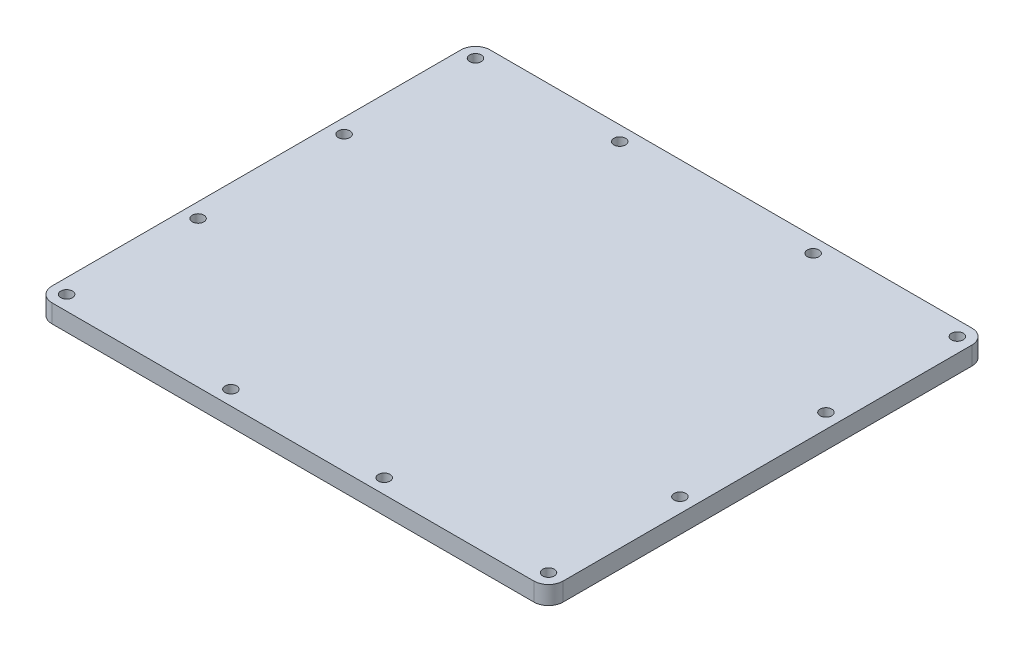
ISO-10303-21;
HEADER;
FILE_DESCRIPTION(('STEP AP214'),'2;1');
FILE_NAME('part.step','',(''),(''),'','','');
FILE_SCHEMA(('AUTOMOTIVE_DESIGN { 1 0 10303 214 1 1 1 1 }'));
ENDSEC;
DATA;
#1=APPLICATION_CONTEXT('core data for automotive mechanical design processes');
#2=APPLICATION_PROTOCOL_DEFINITION('international standard','automotive_design',2000,#1);
#3=PRODUCT_CONTEXT('',#1,'mechanical');
#4=PRODUCT('Part','Part','',(#3));
#5=PRODUCT_RELATED_PRODUCT_CATEGORY('part','',(#4));
#6=PRODUCT_DEFINITION_FORMATION('','',#4);
#7=PRODUCT_DEFINITION_CONTEXT('part definition',#1,'design');
#8=PRODUCT_DEFINITION('design','',#6,#7);
#9=PRODUCT_DEFINITION_SHAPE('','',#8);
#10=(LENGTH_UNIT() NAMED_UNIT(*) SI_UNIT(.MILLI.,.METRE.));
#11=(NAMED_UNIT(*) PLANE_ANGLE_UNIT() SI_UNIT($,.RADIAN.));
#12=(NAMED_UNIT(*) SI_UNIT($,.STERADIAN.) SOLID_ANGLE_UNIT());
#13=UNCERTAINTY_MEASURE_WITH_UNIT(LENGTH_MEASURE(1.E-05),#10,'distance_accuracy_value','');
#14=(GEOMETRIC_REPRESENTATION_CONTEXT(3) GLOBAL_UNCERTAINTY_ASSIGNED_CONTEXT((#13)) GLOBAL_UNIT_ASSIGNED_CONTEXT((#10,
#11,#12)) REPRESENTATION_CONTEXT('',''));
#15=CARTESIAN_POINT('',(0.,0.,0.));
#16=DIRECTION('',(0.,0.,1.));
#17=DIRECTION('',(1.,0.,0.));
#18=AXIS2_PLACEMENT_3D('',#15,#16,#17);
#19=CARTESIAN_POINT('',(66.,5.,56.));
#20=DIRECTION('',(0.,-1.,0.));
#21=DIRECTION('',(0.,0.,-1.));
#22=AXIS2_PLACEMENT_3D('',#19,#20,#21);
#23=PLANE('',#22);
#24=CARTESIAN_POINT('',(66.,5.,56.));
#25=DIRECTION('',(0.,1.,0.));
#26=DIRECTION('',(0.,0.,-1.));
#27=AXIS2_PLACEMENT_3D('',#24,#25,#26);
#28=CIRCLE('',#27,4.);
#29=CARTESIAN_POINT('',(66.,5.,60.));
#30=VERTEX_POINT('',#29);
#31=CARTESIAN_POINT('',(70.,5.,56.));
#32=VERTEX_POINT('',#31);
#33=EDGE_CURVE('E145',#30,#32,#28,.T.);
#34=ORIENTED_EDGE('',*,*,#33,.T.);
#35=DIRECTION('',(0.,0.,-1.));
#36=VECTOR('',#35,1.);
#37=CARTESIAN_POINT('',(70.,5.,56.));
#38=LINE('',#37,#36);
#39=CARTESIAN_POINT('',(70.,5.,-56.));
#40=VERTEX_POINT('',#39);
#41=EDGE_CURVE('E93',#32,#40,#38,.T.);
#42=ORIENTED_EDGE('',*,*,#41,.T.);
#43=CARTESIAN_POINT('',(66.,5.,-56.));
#44=DIRECTION('',(0.,1.,0.));
#45=DIRECTION('',(0.,0.,-1.));
#46=AXIS2_PLACEMENT_3D('',#43,#44,#45);
#47=CIRCLE('',#46,4.);
#48=CARTESIAN_POINT('',(66.,5.,-60.));
#49=VERTEX_POINT('',#48);
#50=EDGE_CURVE('E160',#40,#49,#47,.T.);
#51=ORIENTED_EDGE('',*,*,#50,.T.);
#52=DIRECTION('',(-1.,0.,0.));
#53=VECTOR('',#52,1.);
#54=CARTESIAN_POINT('',(-66.,5.,-60.));
#55=LINE('',#54,#53);
#56=CARTESIAN_POINT('',(-66.,5.,-60.));
#57=VERTEX_POINT('',#56);
#58=EDGE_CURVE('E173',#49,#57,#55,.T.);
#59=ORIENTED_EDGE('',*,*,#58,.T.);
#60=CARTESIAN_POINT('',(-66.,5.,-56.));
#61=DIRECTION('',(0.,1.,0.));
#62=DIRECTION('',(0.,0.,1.));
#63=AXIS2_PLACEMENT_3D('',#60,#61,#62);
#64=CIRCLE('',#63,4.);
#65=CARTESIAN_POINT('',(-70.,5.,-56.));
#66=VERTEX_POINT('',#65);
#67=EDGE_CURVE('E112',#57,#66,#64,.T.);
#68=ORIENTED_EDGE('',*,*,#67,.T.);
#69=DIRECTION('',(0.,0.,1.));
#70=VECTOR('',#69,1.);
#71=CARTESIAN_POINT('',(-70.,5.,56.));
#72=LINE('',#71,#70);
#73=CARTESIAN_POINT('',(-70.,5.,56.));
#74=VERTEX_POINT('',#73);
#75=EDGE_CURVE('E106',#66,#74,#72,.T.);
#76=ORIENTED_EDGE('',*,*,#75,.T.);
#77=CARTESIAN_POINT('',(-66.,5.,56.));
#78=DIRECTION('',(0.,1.,0.));
#79=DIRECTION('',(0.,0.,1.));
#80=AXIS2_PLACEMENT_3D('',#77,#78,#79);
#81=CIRCLE('',#80,4.);
#82=CARTESIAN_POINT('',(-66.,5.,60.));
#83=VERTEX_POINT('',#82);
#84=EDGE_CURVE('E110',#74,#83,#81,.T.);
#85=ORIENTED_EDGE('',*,*,#84,.T.);
#86=DIRECTION('',(1.,0.,0.));
#87=VECTOR('',#86,1.);
#88=CARTESIAN_POINT('',(-66.,5.,60.));
#89=LINE('',#88,#87);
#90=EDGE_CURVE('E50',#83,#30,#89,.T.);
#91=ORIENTED_EDGE('',*,*,#90,.T.);
#92=EDGE_LOOP('',(#34,#42,#51,#59,#68,#76,#85,#91));
#93=FACE_BOUND('',#92,.T.);
#94=CARTESIAN_POINT('',(-66.,5.,-56.));
#95=DIRECTION('',(0.,1.,0.));
#96=DIRECTION('',(0.,0.,1.));
#97=AXIS2_PLACEMENT_3D('',#94,#95,#96);
#98=CIRCLE('',#97,1.60000000000001);
#99=CARTESIAN_POINT('',(-66.,5.,-54.4));
#100=VERTEX_POINT('',#99);
#101=EDGE_CURVE('E134',#100,#100,#98,.T.);
#102=ORIENTED_EDGE('',*,*,#101,.F.);
#103=EDGE_LOOP('',(#102));
#104=FACE_BOUND('',#103,.T.);
#105=CARTESIAN_POINT('',(-66.,5.,56.));
#106=DIRECTION('',(0.,1.,0.));
#107=DIRECTION('',(0.,0.,1.));
#108=AXIS2_PLACEMENT_3D('',#105,#106,#107);
#109=CIRCLE('',#108,1.60000000000001);
#110=CARTESIAN_POINT('',(-66.,5.,57.6));
#111=VERTEX_POINT('',#110);
#112=EDGE_CURVE('E182',#111,#111,#109,.T.);
#113=ORIENTED_EDGE('',*,*,#112,.F.);
#114=EDGE_LOOP('',(#113));
#115=FACE_BOUND('',#114,.T.);
#116=CARTESIAN_POINT('',(66.,5.,56.));
#117=DIRECTION('',(0.,1.,0.));
#118=DIRECTION('',(0.,0.,1.));
#119=AXIS2_PLACEMENT_3D('',#116,#117,#118);
#120=CIRCLE('',#119,1.60000000000001);
#121=CARTESIAN_POINT('',(66.,5.,57.6));
#122=VERTEX_POINT('',#121);
#123=EDGE_CURVE('E188',#122,#122,#120,.T.);
#124=ORIENTED_EDGE('',*,*,#123,.F.);
#125=EDGE_LOOP('',(#124));
#126=FACE_BOUND('',#125,.T.);
#127=CARTESIAN_POINT('',(66.,5.,-56.));
#128=DIRECTION('',(0.,1.,0.));
#129=DIRECTION('',(0.,0.,1.));
#130=AXIS2_PLACEMENT_3D('',#127,#128,#129);
#131=CIRCLE('',#130,1.60000000000001);
#132=CARTESIAN_POINT('',(66.,5.,-54.4));
#133=VERTEX_POINT('',#132);
#134=EDGE_CURVE('E194',#133,#133,#131,.T.);
#135=ORIENTED_EDGE('',*,*,#134,.F.);
#136=EDGE_LOOP('',(#135));
#137=FACE_BOUND('',#136,.T.);
#138=CARTESIAN_POINT('',(-66.,5.,20.));
#139=DIRECTION('',(0.,1.,0.));
#140=DIRECTION('',(0.,0.,1.));
#141=AXIS2_PLACEMENT_3D('',#138,#139,#140);
#142=CIRCLE('',#141,1.6);
#143=CARTESIAN_POINT('',(-66.,5.,21.6));
#144=VERTEX_POINT('',#143);
#145=EDGE_CURVE('E200',#144,#144,#142,.T.);
#146=ORIENTED_EDGE('',*,*,#145,.F.);
#147=EDGE_LOOP('',(#146));
#148=FACE_BOUND('',#147,.T.);
#149=CARTESIAN_POINT('',(66.,5.,20.));
#150=DIRECTION('',(0.,1.,0.));
#151=DIRECTION('',(0.,0.,1.));
#152=AXIS2_PLACEMENT_3D('',#149,#150,#151);
#153=CIRCLE('',#152,1.6);
#154=CARTESIAN_POINT('',(66.,5.,21.6));
#155=VERTEX_POINT('',#154);
#156=EDGE_CURVE('E206',#155,#155,#153,.T.);
#157=ORIENTED_EDGE('',*,*,#156,.F.);
#158=EDGE_LOOP('',(#157));
#159=FACE_BOUND('',#158,.T.);
#160=CARTESIAN_POINT('',(-66.,5.,-20.));
#161=DIRECTION('',(0.,1.,0.));
#162=DIRECTION('',(0.,0.,1.));
#163=AXIS2_PLACEMENT_3D('',#160,#161,#162);
#164=CIRCLE('',#163,1.6);
#165=CARTESIAN_POINT('',(-66.,5.,-18.4));
#166=VERTEX_POINT('',#165);
#167=EDGE_CURVE('E212',#166,#166,#164,.T.);
#168=ORIENTED_EDGE('',*,*,#167,.F.);
#169=EDGE_LOOP('',(#168));
#170=FACE_BOUND('',#169,.T.);
#171=CARTESIAN_POINT('',(66.,5.,-20.));
#172=DIRECTION('',(0.,1.,0.));
#173=DIRECTION('',(0.,0.,1.));
#174=AXIS2_PLACEMENT_3D('',#171,#172,#173);
#175=CIRCLE('',#174,1.6);
#176=CARTESIAN_POINT('',(66.,5.,-18.4));
#177=VERTEX_POINT('',#176);
#178=EDGE_CURVE('E218',#177,#177,#175,.T.);
#179=ORIENTED_EDGE('',*,*,#178,.F.);
#180=EDGE_LOOP('',(#179));
#181=FACE_BOUND('',#180,.T.);
#182=CARTESIAN_POINT('',(-21.,5.,56.));
#183=DIRECTION('',(0.,1.,0.));
#184=DIRECTION('',(0.,0.,1.));
#185=AXIS2_PLACEMENT_3D('',#182,#183,#184);
#186=CIRCLE('',#185,1.6);
#187=CARTESIAN_POINT('',(-21.,5.,57.6));
#188=VERTEX_POINT('',#187);
#189=EDGE_CURVE('E224',#188,#188,#186,.T.);
#190=ORIENTED_EDGE('',*,*,#189,.F.);
#191=EDGE_LOOP('',(#190));
#192=FACE_BOUND('',#191,.T.);
#193=CARTESIAN_POINT('',(21.,5.,56.));
#194=DIRECTION('',(0.,1.,0.));
#195=DIRECTION('',(0.,0.,1.));
#196=AXIS2_PLACEMENT_3D('',#193,#194,#195);
#197=CIRCLE('',#196,1.6);
#198=CARTESIAN_POINT('',(21.,5.,57.6));
#199=VERTEX_POINT('',#198);
#200=EDGE_CURVE('E230',#199,#199,#197,.T.);
#201=ORIENTED_EDGE('',*,*,#200,.F.);
#202=EDGE_LOOP('',(#201));
#203=FACE_BOUND('',#202,.T.);
#204=CARTESIAN_POINT('',(-26.5,5.,-56.));
#205=DIRECTION('',(0.,1.,0.));
#206=DIRECTION('',(0.,0.,1.));
#207=AXIS2_PLACEMENT_3D('',#204,#205,#206);
#208=CIRCLE('',#207,1.6);
#209=CARTESIAN_POINT('',(-26.5,5.,-54.4));
#210=VERTEX_POINT('',#209);
#211=EDGE_CURVE('E236',#210,#210,#208,.T.);
#212=ORIENTED_EDGE('',*,*,#211,.F.);
#213=EDGE_LOOP('',(#212));
#214=FACE_BOUND('',#213,.T.);
#215=CARTESIAN_POINT('',(26.5,5.,-56.));
#216=DIRECTION('',(0.,1.,0.));
#217=DIRECTION('',(0.,0.,1.));
#218=AXIS2_PLACEMENT_3D('',#215,#216,#217);
#219=CIRCLE('',#218,1.6);
#220=CARTESIAN_POINT('',(26.5,5.,-54.4));
#221=VERTEX_POINT('',#220);
#222=EDGE_CURVE('E242',#221,#221,#219,.T.);
#223=ORIENTED_EDGE('',*,*,#222,.F.);
#224=EDGE_LOOP('',(#223));
#225=FACE_BOUND('',#224,.T.);
#226=ADVANCED_FACE('F33',(#93,#104,#115,#126,#137,#148,#159,#170,#181,#192,#203,#214,#225),#23,.F.);
#227=CARTESIAN_POINT('',(66.,0.,56.));
#228=DIRECTION('',(0.,-1.,0.));
#229=DIRECTION('',(0.,0.,-1.));
#230=AXIS2_PLACEMENT_3D('',#227,#228,#229);
#231=PLANE('',#230);
#232=CARTESIAN_POINT('',(-26.5,0.,-56.));
#233=DIRECTION('',(0.,1.,0.));
#234=DIRECTION('',(0.,0.,1.));
#235=AXIS2_PLACEMENT_3D('',#232,#233,#234);
#236=CIRCLE('',#235,1.6);
#237=CARTESIAN_POINT('',(-26.5,0.,-54.4));
#238=VERTEX_POINT('',#237);
#239=EDGE_CURVE('E239',#238,#238,#236,.T.);
#240=ORIENTED_EDGE('',*,*,#239,.T.);
#241=EDGE_LOOP('',(#240));
#242=FACE_BOUND('',#241,.T.);
#243=CARTESIAN_POINT('',(-21.,0.,56.));
#244=DIRECTION('',(0.,1.,0.));
#245=DIRECTION('',(0.,0.,1.));
#246=AXIS2_PLACEMENT_3D('',#243,#244,#245);
#247=CIRCLE('',#246,1.6);
#248=CARTESIAN_POINT('',(-21.,0.,57.6));
#249=VERTEX_POINT('',#248);
#250=EDGE_CURVE('E227',#249,#249,#247,.T.);
#251=ORIENTED_EDGE('',*,*,#250,.T.);
#252=EDGE_LOOP('',(#251));
#253=FACE_BOUND('',#252,.T.);
#254=CARTESIAN_POINT('',(-66.,0.,-20.));
#255=DIRECTION('',(0.,1.,0.));
#256=DIRECTION('',(0.,0.,1.));
#257=AXIS2_PLACEMENT_3D('',#254,#255,#256);
#258=CIRCLE('',#257,1.6);
#259=CARTESIAN_POINT('',(-66.,0.,-18.4));
#260=VERTEX_POINT('',#259);
#261=EDGE_CURVE('E215',#260,#260,#258,.T.);
#262=ORIENTED_EDGE('',*,*,#261,.T.);
#263=EDGE_LOOP('',(#262));
#264=FACE_BOUND('',#263,.T.);
#265=CARTESIAN_POINT('',(-66.,0.,20.));
#266=DIRECTION('',(0.,1.,0.));
#267=DIRECTION('',(0.,0.,1.));
#268=AXIS2_PLACEMENT_3D('',#265,#266,#267);
#269=CIRCLE('',#268,1.6);
#270=CARTESIAN_POINT('',(-66.,0.,21.6));
#271=VERTEX_POINT('',#270);
#272=EDGE_CURVE('E203',#271,#271,#269,.T.);
#273=ORIENTED_EDGE('',*,*,#272,.T.);
#274=EDGE_LOOP('',(#273));
#275=FACE_BOUND('',#274,.T.);
#276=CARTESIAN_POINT('',(66.,0.,56.));
#277=DIRECTION('',(0.,1.,0.));
#278=DIRECTION('',(0.,0.,1.));
#279=AXIS2_PLACEMENT_3D('',#276,#277,#278);
#280=CIRCLE('',#279,1.60000000000001);
#281=CARTESIAN_POINT('',(66.,0.,57.6));
#282=VERTEX_POINT('',#281);
#283=EDGE_CURVE('E191',#282,#282,#280,.T.);
#284=ORIENTED_EDGE('',*,*,#283,.T.);
#285=EDGE_LOOP('',(#284));
#286=FACE_BOUND('',#285,.T.);
#287=CARTESIAN_POINT('',(-66.,0.,-56.));
#288=DIRECTION('',(0.,1.,0.));
#289=DIRECTION('',(0.,0.,1.));
#290=AXIS2_PLACEMENT_3D('',#287,#288,#289);
#291=CIRCLE('',#290,1.60000000000001);
#292=CARTESIAN_POINT('',(-66.,0.,-54.4));
#293=VERTEX_POINT('',#292);
#294=EDGE_CURVE('E179',#293,#293,#291,.T.);
#295=ORIENTED_EDGE('',*,*,#294,.T.);
#296=EDGE_LOOP('',(#295));
#297=FACE_BOUND('',#296,.T.);
#298=CARTESIAN_POINT('',(66.,0.,56.));
#299=DIRECTION('',(0.,1.,0.));
#300=DIRECTION('',(0.,0.,-1.));
#301=AXIS2_PLACEMENT_3D('',#298,#299,#300);
#302=CIRCLE('',#301,4.);
#303=CARTESIAN_POINT('',(66.,0.,60.));
#304=VERTEX_POINT('',#303);
#305=CARTESIAN_POINT('',(70.,0.,56.));
#306=VERTEX_POINT('',#305);
#307=EDGE_CURVE('E130',#304,#306,#302,.T.);
#308=ORIENTED_EDGE('',*,*,#307,.F.);
#309=DIRECTION('',(1.,0.,0.));
#310=VECTOR('',#309,1.);
#311=CARTESIAN_POINT('',(-66.,0.,60.));
#312=LINE('',#311,#310);
#313=CARTESIAN_POINT('',(-66.,0.,60.));
#314=VERTEX_POINT('',#313);
#315=EDGE_CURVE('E85',#314,#304,#312,.T.);
#316=ORIENTED_EDGE('',*,*,#315,.F.);
#317=CARTESIAN_POINT('',(-66.,0.,56.));
#318=DIRECTION('',(0.,1.,0.));
#319=DIRECTION('',(0.,0.,1.));
#320=AXIS2_PLACEMENT_3D('',#317,#318,#319);
#321=CIRCLE('',#320,4.);
#322=CARTESIAN_POINT('',(-70.,0.,56.));
#323=VERTEX_POINT('',#322);
#324=EDGE_CURVE('E79',#323,#314,#321,.T.);
#325=ORIENTED_EDGE('',*,*,#324,.F.);
#326=DIRECTION('',(0.,0.,1.));
#327=VECTOR('',#326,1.);
#328=CARTESIAN_POINT('',(-70.,0.,56.));
#329=LINE('',#328,#327);
#330=CARTESIAN_POINT('',(-70.,0.,-56.));
#331=VERTEX_POINT('',#330);
#332=EDGE_CURVE('E120',#331,#323,#329,.T.);
#333=ORIENTED_EDGE('',*,*,#332,.F.);
#334=CARTESIAN_POINT('',(-66.,0.,-56.));
#335=DIRECTION('',(0.,1.,0.));
#336=DIRECTION('',(0.,0.,1.));
#337=AXIS2_PLACEMENT_3D('',#334,#335,#336);
#338=CIRCLE('',#337,4.);
#339=CARTESIAN_POINT('',(-66.,0.,-60.));
#340=VERTEX_POINT('',#339);
#341=EDGE_CURVE('E140',#340,#331,#338,.T.);
#342=ORIENTED_EDGE('',*,*,#341,.F.);
#343=DIRECTION('',(-1.,0.,0.));
#344=VECTOR('',#343,1.);
#345=CARTESIAN_POINT('',(-66.,0.,-60.));
#346=LINE('',#345,#344);
#347=CARTESIAN_POINT('',(66.,0.,-60.));
#348=VERTEX_POINT('',#347);
#349=EDGE_CURVE('E138',#348,#340,#346,.T.);
#350=ORIENTED_EDGE('',*,*,#349,.F.);
#351=CARTESIAN_POINT('',(66.,0.,-56.));
#352=DIRECTION('',(0.,1.,0.));
#353=DIRECTION('',(0.,0.,-1.));
#354=AXIS2_PLACEMENT_3D('',#351,#352,#353);
#355=CIRCLE('',#354,4.);
#356=CARTESIAN_POINT('',(70.,0.,-56.));
#357=VERTEX_POINT('',#356);
#358=EDGE_CURVE('E136',#357,#348,#355,.T.);
#359=ORIENTED_EDGE('',*,*,#358,.F.);
#360=DIRECTION('',(0.,0.,-1.));
#361=VECTOR('',#360,1.);
#362=CARTESIAN_POINT('',(70.,0.,56.));
#363=LINE('',#362,#361);
#364=EDGE_CURVE('E133',#306,#357,#363,.T.);
#365=ORIENTED_EDGE('',*,*,#364,.F.);
#366=EDGE_LOOP('',(#308,#316,#325,#333,#342,#350,#359,#365));
#367=FACE_BOUND('',#366,.T.);
#368=CARTESIAN_POINT('',(-66.,0.,56.));
#369=DIRECTION('',(0.,1.,0.));
#370=DIRECTION('',(0.,0.,1.));
#371=AXIS2_PLACEMENT_3D('',#368,#369,#370);
#372=CIRCLE('',#371,1.60000000000001);
#373=CARTESIAN_POINT('',(-66.,0.,57.6));
#374=VERTEX_POINT('',#373);
#375=EDGE_CURVE('E185',#374,#374,#372,.T.);
#376=ORIENTED_EDGE('',*,*,#375,.T.);
#377=EDGE_LOOP('',(#376));
#378=FACE_BOUND('',#377,.T.);
#379=CARTESIAN_POINT('',(66.,0.,-56.));
#380=DIRECTION('',(0.,1.,0.));
#381=DIRECTION('',(0.,0.,1.));
#382=AXIS2_PLACEMENT_3D('',#379,#380,#381);
#383=CIRCLE('',#382,1.60000000000001);
#384=CARTESIAN_POINT('',(66.,0.,-54.4));
#385=VERTEX_POINT('',#384);
#386=EDGE_CURVE('E197',#385,#385,#383,.T.);
#387=ORIENTED_EDGE('',*,*,#386,.T.);
#388=EDGE_LOOP('',(#387));
#389=FACE_BOUND('',#388,.T.);
#390=CARTESIAN_POINT('',(66.,0.,20.));
#391=DIRECTION('',(0.,1.,0.));
#392=DIRECTION('',(0.,0.,1.));
#393=AXIS2_PLACEMENT_3D('',#390,#391,#392);
#394=CIRCLE('',#393,1.6);
#395=CARTESIAN_POINT('',(66.,0.,21.6));
#396=VERTEX_POINT('',#395);
#397=EDGE_CURVE('E209',#396,#396,#394,.T.);
#398=ORIENTED_EDGE('',*,*,#397,.T.);
#399=EDGE_LOOP('',(#398));
#400=FACE_BOUND('',#399,.T.);
#401=CARTESIAN_POINT('',(66.,0.,-20.));
#402=DIRECTION('',(0.,1.,0.));
#403=DIRECTION('',(0.,0.,1.));
#404=AXIS2_PLACEMENT_3D('',#401,#402,#403);
#405=CIRCLE('',#404,1.6);
#406=CARTESIAN_POINT('',(66.,0.,-18.4));
#407=VERTEX_POINT('',#406);
#408=EDGE_CURVE('E221',#407,#407,#405,.T.);
#409=ORIENTED_EDGE('',*,*,#408,.T.);
#410=EDGE_LOOP('',(#409));
#411=FACE_BOUND('',#410,.T.);
#412=CARTESIAN_POINT('',(21.,0.,56.));
#413=DIRECTION('',(0.,1.,0.));
#414=DIRECTION('',(0.,0.,1.));
#415=AXIS2_PLACEMENT_3D('',#412,#413,#414);
#416=CIRCLE('',#415,1.6);
#417=CARTESIAN_POINT('',(21.,0.,57.6));
#418=VERTEX_POINT('',#417);
#419=EDGE_CURVE('E233',#418,#418,#416,.T.);
#420=ORIENTED_EDGE('',*,*,#419,.T.);
#421=EDGE_LOOP('',(#420));
#422=FACE_BOUND('',#421,.T.);
#423=CARTESIAN_POINT('',(26.5,0.,-56.));
#424=DIRECTION('',(0.,1.,0.));
#425=DIRECTION('',(0.,0.,1.));
#426=AXIS2_PLACEMENT_3D('',#423,#424,#425);
#427=CIRCLE('',#426,1.6);
#428=CARTESIAN_POINT('',(26.5,0.,-54.4));
#429=VERTEX_POINT('',#428);
#430=EDGE_CURVE('E245',#429,#429,#427,.T.);
#431=ORIENTED_EDGE('',*,*,#430,.T.);
#432=EDGE_LOOP('',(#431));
#433=FACE_BOUND('',#432,.T.);
#434=ADVANCED_FACE('F164',(#242,#253,#264,#275,#286,#297,#367,#378,#389,#400,#411,#422,#433),
#231,.T.);
#435=CARTESIAN_POINT('',(66.,5.,56.));
#436=DIRECTION('',(0.,-1.,0.));
#437=DIRECTION('',(0.,0.,-1.));
#438=AXIS2_PLACEMENT_3D('',#435,#436,#437);
#439=CYLINDRICAL_SURFACE('',#438,4.);
#440=ORIENTED_EDGE('',*,*,#307,.T.);
#441=DIRECTION('',(0.,-1.,0.));
#442=VECTOR('',#441,1.);
#443=CARTESIAN_POINT('',(70.,5.,56.));
#444=LINE('',#443,#442);
#445=EDGE_CURVE('E11',#32,#306,#444,.T.);
#446=ORIENTED_EDGE('',*,*,#445,.F.);
#447=ORIENTED_EDGE('',*,*,#33,.F.);
#448=DIRECTION('',(0.,-1.,0.));
#449=VECTOR('',#448,1.);
#450=CARTESIAN_POINT('',(66.,5.,60.));
#451=LINE('',#450,#449);
#452=EDGE_CURVE('E126',#30,#304,#451,.T.);
#453=ORIENTED_EDGE('',*,*,#452,.T.);
#454=EDGE_LOOP('',(#440,#446,#447,#453));
#455=FACE_BOUND('',#454,.T.);
#456=ADVANCED_FACE('F35',(#455),#439,.T.);
#457=CARTESIAN_POINT('',(70.,5.,56.));
#458=DIRECTION('',(-1.,0.,0.));
#459=DIRECTION('',(0.,0.,1.));
#460=AXIS2_PLACEMENT_3D('',#457,#458,#459);
#461=PLANE('',#460);
#462=ORIENTED_EDGE('',*,*,#364,.T.);
#463=DIRECTION('',(0.,-1.,0.));
#464=VECTOR('',#463,1.);
#465=CARTESIAN_POINT('',(70.,5.,-56.));
#466=LINE('',#465,#464);
#467=EDGE_CURVE('E42',#40,#357,#466,.T.);
#468=ORIENTED_EDGE('',*,*,#467,.F.);
#469=ORIENTED_EDGE('',*,*,#41,.F.);
#470=ORIENTED_EDGE('',*,*,#445,.T.);
#471=EDGE_LOOP('',(#462,#468,#469,#470));
#472=FACE_BOUND('',#471,.T.);
#473=ADVANCED_FACE('F277',(#472),#461,.F.);
#474=CARTESIAN_POINT('',(66.,5.,-56.));
#475=DIRECTION('',(0.,-1.,0.));
#476=DIRECTION('',(0.,0.,-1.));
#477=AXIS2_PLACEMENT_3D('',#474,#475,#476);
#478=CYLINDRICAL_SURFACE('',#477,4.);
#479=ORIENTED_EDGE('',*,*,#358,.T.);
#480=DIRECTION('',(0.,-1.,0.));
#481=VECTOR('',#480,1.);
#482=CARTESIAN_POINT('',(66.,5.,-60.));
#483=LINE('',#482,#481);
#484=EDGE_CURVE('E152',#49,#348,#483,.T.);
#485=ORIENTED_EDGE('',*,*,#484,.F.);
#486=ORIENTED_EDGE('',*,*,#50,.F.);
#487=ORIENTED_EDGE('',*,*,#467,.T.);
#488=EDGE_LOOP('',(#479,#485,#486,#487));
#489=FACE_BOUND('',#488,.T.);
#490=ADVANCED_FACE('F158',(#489),#478,.T.);
#491=CARTESIAN_POINT('',(-66.,5.,-60.));
#492=DIRECTION('',(0.,0.,1.));
#493=DIRECTION('',(1.,0.,0.));
#494=AXIS2_PLACEMENT_3D('',#491,#492,#493);
#495=PLANE('',#494);
#496=ORIENTED_EDGE('',*,*,#349,.T.);
#497=DIRECTION('',(0.,-1.,0.));
#498=VECTOR('',#497,1.);
#499=CARTESIAN_POINT('',(-66.,5.,-60.));
#500=LINE('',#499,#498);
#501=EDGE_CURVE('E149',#57,#340,#500,.T.);
#502=ORIENTED_EDGE('',*,*,#501,.F.);
#503=ORIENTED_EDGE('',*,*,#58,.F.);
#504=ORIENTED_EDGE('',*,*,#484,.T.);
#505=EDGE_LOOP('',(#496,#502,#503,#504));
#506=FACE_BOUND('',#505,.T.);
#507=ADVANCED_FACE('F169',(#506),#495,.F.);
#508=CARTESIAN_POINT('',(-66.,5.,-56.));
#509=DIRECTION('',(0.,-1.,0.));
#510=DIRECTION('',(0.,0.,-1.));
#511=AXIS2_PLACEMENT_3D('',#508,#509,#510);
#512=CYLINDRICAL_SURFACE('',#511,4.);
#513=ORIENTED_EDGE('',*,*,#341,.T.);
#514=DIRECTION('',(0.,-1.,0.));
#515=VECTOR('',#514,1.);
#516=CARTESIAN_POINT('',(-70.,5.,-56.));
#517=LINE('',#516,#515);
#518=EDGE_CURVE('E121',#66,#331,#517,.T.);
#519=ORIENTED_EDGE('',*,*,#518,.F.);
#520=ORIENTED_EDGE('',*,*,#67,.F.);
#521=ORIENTED_EDGE('',*,*,#501,.T.);
#522=EDGE_LOOP('',(#513,#519,#520,#521));
#523=FACE_BOUND('',#522,.T.);
#524=ADVANCED_FACE('F172',(#523),#512,.T.);
#525=CARTESIAN_POINT('',(-70.,5.,56.));
#526=DIRECTION('',(1.,0.,0.));
#527=DIRECTION('',(0.,0.,-1.));
#528=AXIS2_PLACEMENT_3D('',#525,#526,#527);
#529=PLANE('',#528);
#530=ORIENTED_EDGE('',*,*,#332,.T.);
#531=DIRECTION('',(0.,-1.,0.));
#532=VECTOR('',#531,1.);
#533=CARTESIAN_POINT('',(-70.,5.,56.));
#534=LINE('',#533,#532);
#535=EDGE_CURVE('E117',#74,#323,#534,.T.);
#536=ORIENTED_EDGE('',*,*,#535,.F.);
#537=ORIENTED_EDGE('',*,*,#75,.F.);
#538=ORIENTED_EDGE('',*,*,#518,.T.);
#539=EDGE_LOOP('',(#530,#536,#537,#538));
#540=FACE_BOUND('',#539,.T.);
#541=ADVANCED_FACE('F118',(#540),#529,.F.);
#542=CARTESIAN_POINT('',(-66.,5.,56.));
#543=DIRECTION('',(0.,-1.,0.));
#544=DIRECTION('',(0.,0.,-1.));
#545=AXIS2_PLACEMENT_3D('',#542,#543,#544);
#546=CYLINDRICAL_SURFACE('',#545,4.);
#547=ORIENTED_EDGE('',*,*,#324,.T.);
#548=DIRECTION('',(0.,-1.,0.));
#549=VECTOR('',#548,1.);
#550=CARTESIAN_POINT('',(-66.,5.,60.));
#551=LINE('',#550,#549);
#552=EDGE_CURVE('E122',#83,#314,#551,.T.);
#553=ORIENTED_EDGE('',*,*,#552,.F.);
#554=ORIENTED_EDGE('',*,*,#84,.F.);
#555=ORIENTED_EDGE('',*,*,#535,.T.);
#556=EDGE_LOOP('',(#547,#553,#554,#555));
#557=FACE_BOUND('',#556,.T.);
#558=ADVANCED_FACE('F124',(#557),#546,.T.);
#559=CARTESIAN_POINT('',(-66.,5.,60.));
#560=DIRECTION('',(0.,0.,-1.));
#561=DIRECTION('',(-1.,0.,0.));
#562=AXIS2_PLACEMENT_3D('',#559,#560,#561);
#563=PLANE('',#562);
#564=ORIENTED_EDGE('',*,*,#315,.T.);
#565=ORIENTED_EDGE('',*,*,#452,.F.);
#566=ORIENTED_EDGE('',*,*,#90,.F.);
#567=ORIENTED_EDGE('',*,*,#552,.T.);
#568=EDGE_LOOP('',(#564,#565,#566,#567));
#569=FACE_BOUND('',#568,.T.);
#570=ADVANCED_FACE('F265',(#569),#563,.F.);
#571=CARTESIAN_POINT('',(-66.,5.,-56.));
#572=DIRECTION('',(0.,-1.,0.));
#573=DIRECTION('',(0.,0.,-1.));
#574=AXIS2_PLACEMENT_3D('',#571,#572,#573);
#575=CYLINDRICAL_SURFACE('',#574,1.60000000000001);
#576=ORIENTED_EDGE('',*,*,#101,.T.);
#577=EDGE_LOOP('',(#576));
#578=FACE_BOUND('',#577,.T.);
#579=ORIENTED_EDGE('',*,*,#294,.F.);
#580=EDGE_LOOP('',(#579));
#581=FACE_BOUND('',#580,.T.);
#582=ADVANCED_FACE('F262',(#578,#581),#575,.F.);
#583=CARTESIAN_POINT('',(-66.,5.,56.));
#584=DIRECTION('',(0.,-1.,0.));
#585=DIRECTION('',(0.,0.,-1.));
#586=AXIS2_PLACEMENT_3D('',#583,#584,#585);
#587=CYLINDRICAL_SURFACE('',#586,1.60000000000001);
#588=ORIENTED_EDGE('',*,*,#112,.T.);
#589=EDGE_LOOP('',(#588));
#590=FACE_BOUND('',#589,.T.);
#591=ORIENTED_EDGE('',*,*,#375,.F.);
#592=EDGE_LOOP('',(#591));
#593=FACE_BOUND('',#592,.T.);
#594=ADVANCED_FACE('F341',(#590,#593),#587,.F.);
#595=CARTESIAN_POINT('',(66.,5.,56.));
#596=DIRECTION('',(0.,-1.,0.));
#597=DIRECTION('',(0.,0.,-1.));
#598=AXIS2_PLACEMENT_3D('',#595,#596,#597);
#599=CYLINDRICAL_SURFACE('',#598,1.60000000000001);
#600=ORIENTED_EDGE('',*,*,#123,.T.);
#601=EDGE_LOOP('',(#600));
#602=FACE_BOUND('',#601,.T.);
#603=ORIENTED_EDGE('',*,*,#283,.F.);
#604=EDGE_LOOP('',(#603));
#605=FACE_BOUND('',#604,.T.);
#606=ADVANCED_FACE('F349',(#602,#605),#599,.F.);
#607=CARTESIAN_POINT('',(66.,5.,-56.));
#608=DIRECTION('',(0.,-1.,0.));
#609=DIRECTION('',(0.,0.,-1.));
#610=AXIS2_PLACEMENT_3D('',#607,#608,#609);
#611=CYLINDRICAL_SURFACE('',#610,1.60000000000001);
#612=ORIENTED_EDGE('',*,*,#134,.T.);
#613=EDGE_LOOP('',(#612));
#614=FACE_BOUND('',#613,.T.);
#615=ORIENTED_EDGE('',*,*,#386,.F.);
#616=EDGE_LOOP('',(#615));
#617=FACE_BOUND('',#616,.T.);
#618=ADVANCED_FACE('F357',(#614,#617),#611,.F.);
#619=CARTESIAN_POINT('',(-66.,5.,20.));
#620=DIRECTION('',(0.,-1.,0.));
#621=DIRECTION('',(0.,0.,-1.));
#622=AXIS2_PLACEMENT_3D('',#619,#620,#621);
#623=CYLINDRICAL_SURFACE('',#622,1.6);
#624=ORIENTED_EDGE('',*,*,#145,.T.);
#625=EDGE_LOOP('',(#624));
#626=FACE_BOUND('',#625,.T.);
#627=ORIENTED_EDGE('',*,*,#272,.F.);
#628=EDGE_LOOP('',(#627));
#629=FACE_BOUND('',#628,.T.);
#630=ADVANCED_FACE('F366',(#626,#629),#623,.F.);
#631=CARTESIAN_POINT('',(66.,5.,20.));
#632=DIRECTION('',(0.,-1.,0.));
#633=DIRECTION('',(0.,0.,-1.));
#634=AXIS2_PLACEMENT_3D('',#631,#632,#633);
#635=CYLINDRICAL_SURFACE('',#634,1.6);
#636=ORIENTED_EDGE('',*,*,#156,.T.);
#637=EDGE_LOOP('',(#636));
#638=FACE_BOUND('',#637,.T.);
#639=ORIENTED_EDGE('',*,*,#397,.F.);
#640=EDGE_LOOP('',(#639));
#641=FACE_BOUND('',#640,.T.);
#642=ADVANCED_FACE('F375',(#638,#641),#635,.F.);
#643=CARTESIAN_POINT('',(-66.,5.,-20.));
#644=DIRECTION('',(0.,-1.,0.));
#645=DIRECTION('',(0.,0.,-1.));
#646=AXIS2_PLACEMENT_3D('',#643,#644,#645);
#647=CYLINDRICAL_SURFACE('',#646,1.6);
#648=ORIENTED_EDGE('',*,*,#167,.T.);
#649=EDGE_LOOP('',(#648));
#650=FACE_BOUND('',#649,.T.);
#651=ORIENTED_EDGE('',*,*,#261,.F.);
#652=EDGE_LOOP('',(#651));
#653=FACE_BOUND('',#652,.T.);
#654=ADVANCED_FACE('F384',(#650,#653),#647,.F.);
#655=CARTESIAN_POINT('',(66.,5.,-20.));
#656=DIRECTION('',(0.,-1.,0.));
#657=DIRECTION('',(0.,0.,-1.));
#658=AXIS2_PLACEMENT_3D('',#655,#656,#657);
#659=CYLINDRICAL_SURFACE('',#658,1.6);
#660=ORIENTED_EDGE('',*,*,#178,.T.);
#661=EDGE_LOOP('',(#660));
#662=FACE_BOUND('',#661,.T.);
#663=ORIENTED_EDGE('',*,*,#408,.F.);
#664=EDGE_LOOP('',(#663));
#665=FACE_BOUND('',#664,.T.);
#666=ADVANCED_FACE('F393',(#662,#665),#659,.F.);
#667=CARTESIAN_POINT('',(-21.,5.,56.));
#668=DIRECTION('',(0.,-1.,0.));
#669=DIRECTION('',(0.,0.,-1.));
#670=AXIS2_PLACEMENT_3D('',#667,#668,#669);
#671=CYLINDRICAL_SURFACE('',#670,1.6);
#672=ORIENTED_EDGE('',*,*,#189,.T.);
#673=EDGE_LOOP('',(#672));
#674=FACE_BOUND('',#673,.T.);
#675=ORIENTED_EDGE('',*,*,#250,.F.);
#676=EDGE_LOOP('',(#675));
#677=FACE_BOUND('',#676,.T.);
#678=ADVANCED_FACE('F402',(#674,#677),#671,.F.);
#679=CARTESIAN_POINT('',(21.,5.,56.));
#680=DIRECTION('',(0.,-1.,0.));
#681=DIRECTION('',(0.,0.,-1.));
#682=AXIS2_PLACEMENT_3D('',#679,#680,#681);
#683=CYLINDRICAL_SURFACE('',#682,1.6);
#684=ORIENTED_EDGE('',*,*,#200,.T.);
#685=EDGE_LOOP('',(#684));
#686=FACE_BOUND('',#685,.T.);
#687=ORIENTED_EDGE('',*,*,#419,.F.);
#688=EDGE_LOOP('',(#687));
#689=FACE_BOUND('',#688,.T.);
#690=ADVANCED_FACE('F411',(#686,#689),#683,.F.);
#691=CARTESIAN_POINT('',(-26.5,5.,-56.));
#692=DIRECTION('',(0.,-1.,0.));
#693=DIRECTION('',(0.,0.,-1.));
#694=AXIS2_PLACEMENT_3D('',#691,#692,#693);
#695=CYLINDRICAL_SURFACE('',#694,1.6);
#696=ORIENTED_EDGE('',*,*,#211,.T.);
#697=EDGE_LOOP('',(#696));
#698=FACE_BOUND('',#697,.T.);
#699=ORIENTED_EDGE('',*,*,#239,.F.);
#700=EDGE_LOOP('',(#699));
#701=FACE_BOUND('',#700,.T.);
#702=ADVANCED_FACE('F420',(#698,#701),#695,.F.);
#703=CARTESIAN_POINT('',(26.5,5.,-56.));
#704=DIRECTION('',(0.,-1.,0.));
#705=DIRECTION('',(0.,0.,-1.));
#706=AXIS2_PLACEMENT_3D('',#703,#704,#705);
#707=CYLINDRICAL_SURFACE('',#706,1.6);
#708=ORIENTED_EDGE('',*,*,#222,.T.);
#709=EDGE_LOOP('',(#708));
#710=FACE_BOUND('',#709,.T.);
#711=ORIENTED_EDGE('',*,*,#430,.F.);
#712=EDGE_LOOP('',(#711));
#713=FACE_BOUND('',#712,.T.);
#714=ADVANCED_FACE('F251',(#710,#713),#707,.F.);
#715=CLOSED_SHELL('',(#226,#434,#456,#473,#490,#507,#524,#541,#558,#570,#582,#594,#606,#618,
#630,#642,#654,#666,#678,#690,#702,#714));
#716=MANIFOLD_SOLID_BREP('B2',#715);
#717=ADVANCED_BREP_SHAPE_REPRESENTATION('',(#18,#716),#14);
#718=SHAPE_DEFINITION_REPRESENTATION(#9,#717);
ENDSEC;
END-ISO-10303-21;
